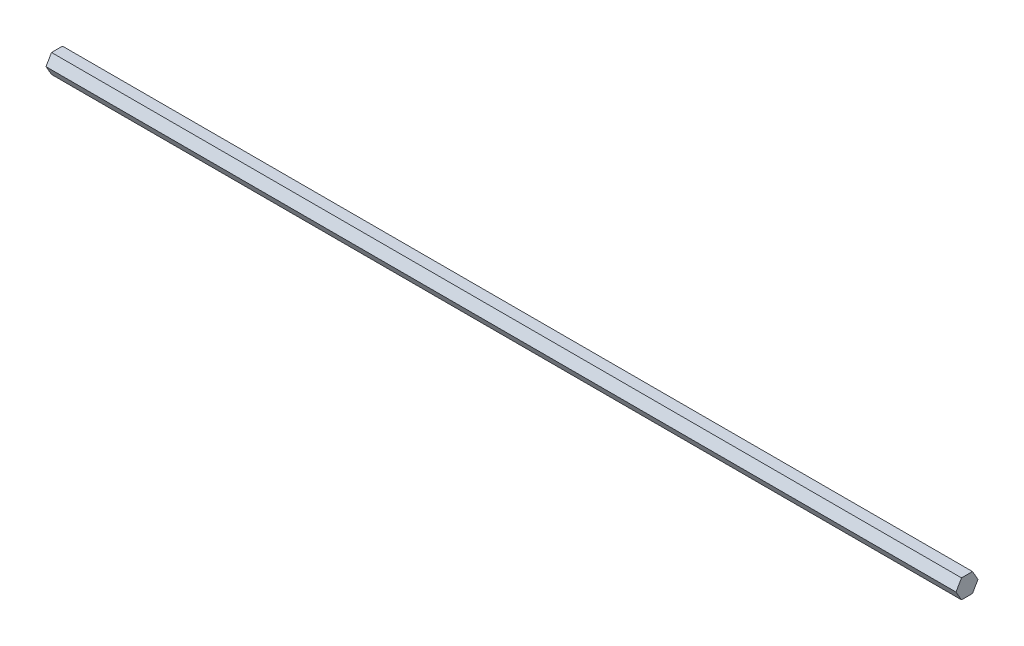
ISO-10303-21;
HEADER;
FILE_DESCRIPTION(('STEP AP214'),'2;1');
FILE_NAME('part.step','',(''),(''),'','','');
FILE_SCHEMA(('AUTOMOTIVE_DESIGN { 1 0 10303 214 1 1 1 1 }'));
ENDSEC;
DATA;
#1=APPLICATION_CONTEXT('core data for automotive mechanical design processes');
#2=APPLICATION_PROTOCOL_DEFINITION('international standard','automotive_design',2000,#1);
#3=PRODUCT_CONTEXT('',#1,'mechanical');
#4=PRODUCT('Part','Part','',(#3));
#5=PRODUCT_RELATED_PRODUCT_CATEGORY('part','',(#4));
#6=PRODUCT_DEFINITION_FORMATION('','',#4);
#7=PRODUCT_DEFINITION_CONTEXT('part definition',#1,'design');
#8=PRODUCT_DEFINITION('design','',#6,#7);
#9=PRODUCT_DEFINITION_SHAPE('','',#8);
#10=(LENGTH_UNIT() NAMED_UNIT(*) SI_UNIT(.MILLI.,.METRE.));
#11=(NAMED_UNIT(*) PLANE_ANGLE_UNIT() SI_UNIT($,.RADIAN.));
#12=(NAMED_UNIT(*) SI_UNIT($,.STERADIAN.) SOLID_ANGLE_UNIT());
#13=UNCERTAINTY_MEASURE_WITH_UNIT(LENGTH_MEASURE(1.E-05),#10,'distance_accuracy_value','');
#14=(GEOMETRIC_REPRESENTATION_CONTEXT(3) GLOBAL_UNCERTAINTY_ASSIGNED_CONTEXT((#13)) GLOBAL_UNIT_ASSIGNED_CONTEXT((#10,
#11,#12)) REPRESENTATION_CONTEXT('',''));
#15=CARTESIAN_POINT('',(0.,0.,0.));
#16=DIRECTION('',(0.,0.,1.));
#17=DIRECTION('',(1.,0.,0.));
#18=AXIS2_PLACEMENT_3D('',#15,#16,#17);
#19=CARTESIAN_POINT('',(303.2125,-6.34999999999996,-3.6661742093542));
#20=DIRECTION('',(0.,0.499999999999995,0.866025403784442));
#21=DIRECTION('',(0.,-0.866025403784441,0.499999999999995));
#22=AXIS2_PLACEMENT_3D('',#19,#20,#21);
#23=PLANE('',#22);
#24=DIRECTION('',(0.,0.866025403784442,-0.499999999999995));
#25=VECTOR('',#24,1.);
#26=CARTESIAN_POINT('',(-303.2125,-6.34999999999996,-3.6661742093542));
#27=LINE('',#26,#25);
#28=CARTESIAN_POINT('',(-303.2125,-6.34999999999996,-3.6661742093542));
#29=VERTEX_POINT('',#28);
#30=CARTESIAN_POINT('',(-303.2125,0.,-7.33234841870825));
#31=VERTEX_POINT('',#30);
#32=EDGE_CURVE('E117',#29,#31,#27,.T.);
#33=ORIENTED_EDGE('',*,*,#32,.T.);
#34=DIRECTION('',(-1.,0.,0.));
#35=VECTOR('',#34,1.);
#36=CARTESIAN_POINT('',(303.2125,0.,-7.33234841870825));
#37=LINE('',#36,#35);
#38=CARTESIAN_POINT('',(303.2125,0.,-7.33234841870825));
#39=VERTEX_POINT('',#38);
#40=EDGE_CURVE('E11',#39,#31,#37,.T.);
#41=ORIENTED_EDGE('',*,*,#40,.F.);
#42=DIRECTION('',(0.,0.866025403784442,-0.499999999999995));
#43=VECTOR('',#42,1.);
#44=CARTESIAN_POINT('',(303.2125,-6.34999999999996,-3.6661742093542));
#45=LINE('',#44,#43);
#46=CARTESIAN_POINT('',(303.2125,-6.34999999999996,-3.6661742093542));
#47=VERTEX_POINT('',#46);
#48=EDGE_CURVE('E127',#47,#39,#45,.T.);
#49=ORIENTED_EDGE('',*,*,#48,.F.);
#50=DIRECTION('',(-1.,0.,0.));
#51=VECTOR('',#50,1.);
#52=CARTESIAN_POINT('',(303.2125,-6.34999999999996,-3.6661742093542));
#53=LINE('',#52,#51);
#54=EDGE_CURVE('E113',#47,#29,#53,.T.);
#55=ORIENTED_EDGE('',*,*,#54,.T.);
#56=EDGE_LOOP('',(#33,#41,#49,#55));
#57=FACE_BOUND('',#56,.T.);
#58=ADVANCED_FACE('F33',(#57),#23,.F.);
#59=CARTESIAN_POINT('',(303.2125,0.,-7.33234841870825));
#60=DIRECTION('',(0.,-0.500000000000001,0.866025403784438));
#61=DIRECTION('',(0.,-0.866025403784438,-0.500000000000001));
#62=AXIS2_PLACEMENT_3D('',#59,#60,#61);
#63=PLANE('',#62);
#64=DIRECTION('',(0.,0.866025403784438,0.500000000000001));
#65=VECTOR('',#64,1.);
#66=CARTESIAN_POINT('',(-303.2125,0.,-7.33234841870825));
#67=LINE('',#66,#65);
#68=CARTESIAN_POINT('',(-303.2125,6.35000000000001,-3.66617420935411));
#69=VERTEX_POINT('',#68);
#70=EDGE_CURVE('E120',#31,#69,#67,.T.);
#71=ORIENTED_EDGE('',*,*,#70,.T.);
#72=DIRECTION('',(-1.,0.,0.));
#73=VECTOR('',#72,1.);
#74=CARTESIAN_POINT('',(303.2125,6.35000000000001,-3.66617420935411));
#75=LINE('',#74,#73);
#76=CARTESIAN_POINT('',(303.2125,6.35000000000001,-3.66617420935411));
#77=VERTEX_POINT('',#76);
#78=EDGE_CURVE('E41',#77,#69,#75,.T.);
#79=ORIENTED_EDGE('',*,*,#78,.F.);
#80=DIRECTION('',(0.,0.866025403784438,0.500000000000001));
#81=VECTOR('',#80,1.);
#82=CARTESIAN_POINT('',(303.2125,0.,-7.33234841870825));
#83=LINE('',#82,#81);
#84=EDGE_CURVE('E86',#39,#77,#83,.T.);
#85=ORIENTED_EDGE('',*,*,#84,.F.);
#86=ORIENTED_EDGE('',*,*,#40,.T.);
#87=EDGE_LOOP('',(#71,#79,#85,#86));
#88=FACE_BOUND('',#87,.T.);
#89=ADVANCED_FACE('F151',(#88),#63,.F.);
#90=CARTESIAN_POINT('',(303.2125,6.35000000000001,-3.66617420935411));
#91=DIRECTION('',(0.,-1.,0.));
#92=DIRECTION('',(0.,0.,-1.));
#93=AXIS2_PLACEMENT_3D('',#90,#91,#92);
#94=PLANE('',#93);
#95=DIRECTION('',(0.,0.,1.));
#96=VECTOR('',#95,1.);
#97=CARTESIAN_POINT('',(-303.2125,6.35000000000001,-3.66617420935411));
#98=LINE('',#97,#96);
#99=CARTESIAN_POINT('',(-303.2125,6.34999999999999,3.66617420935416));
#100=VERTEX_POINT('',#99);
#101=EDGE_CURVE('E122',#69,#100,#98,.T.);
#102=ORIENTED_EDGE('',*,*,#101,.T.);
#103=DIRECTION('',(-1.,0.,0.));
#104=VECTOR('',#103,1.);
#105=CARTESIAN_POINT('',(303.2125,6.34999999999999,3.66617420935416));
#106=LINE('',#105,#104);
#107=CARTESIAN_POINT('',(303.2125,6.34999999999999,3.66617420935416));
#108=VERTEX_POINT('',#107);
#109=EDGE_CURVE('E108',#108,#100,#106,.T.);
#110=ORIENTED_EDGE('',*,*,#109,.F.);
#111=DIRECTION('',(0.,0.,1.));
#112=VECTOR('',#111,1.);
#113=CARTESIAN_POINT('',(303.2125,6.35000000000001,-3.66617420935411));
#114=LINE('',#113,#112);
#115=EDGE_CURVE('E99',#77,#108,#114,.T.);
#116=ORIENTED_EDGE('',*,*,#115,.F.);
#117=ORIENTED_EDGE('',*,*,#78,.T.);
#118=EDGE_LOOP('',(#102,#110,#116,#117));
#119=FACE_BOUND('',#118,.T.);
#120=ADVANCED_FACE('F133',(#119),#94,.F.);
#121=CARTESIAN_POINT('',(303.2125,6.34999999999999,3.66617420935416));
#122=DIRECTION('',(0.,-0.499999999999995,-0.866025403784441));
#123=DIRECTION('',(0.,0.866025403784442,-0.499999999999995));
#124=AXIS2_PLACEMENT_3D('',#121,#122,#123);
#125=PLANE('',#124);
#126=DIRECTION('',(0.,-0.866025403784442,0.499999999999995));
#127=VECTOR('',#126,1.);
#128=CARTESIAN_POINT('',(-303.2125,6.34999999999999,3.66617420935416));
#129=LINE('',#128,#127);
#130=CARTESIAN_POINT('',(-303.2125,0.,7.33234841870825));
#131=VERTEX_POINT('',#130);
#132=EDGE_CURVE('E107',#100,#131,#129,.T.);
#133=ORIENTED_EDGE('',*,*,#132,.T.);
#134=DIRECTION('',(-1.,0.,0.));
#135=VECTOR('',#134,1.);
#136=CARTESIAN_POINT('',(303.2125,0.,7.33234841870825));
#137=LINE('',#136,#135);
#138=CARTESIAN_POINT('',(303.2125,0.,7.33234841870825));
#139=VERTEX_POINT('',#138);
#140=EDGE_CURVE('E104',#139,#131,#137,.T.);
#141=ORIENTED_EDGE('',*,*,#140,.F.);
#142=DIRECTION('',(0.,-0.866025403784442,0.499999999999995));
#143=VECTOR('',#142,1.);
#144=CARTESIAN_POINT('',(303.2125,6.34999999999999,3.66617420935416));
#145=LINE('',#144,#143);
#146=EDGE_CURVE('E93',#108,#139,#145,.T.);
#147=ORIENTED_EDGE('',*,*,#146,.F.);
#148=ORIENTED_EDGE('',*,*,#109,.T.);
#149=EDGE_LOOP('',(#133,#141,#147,#148));
#150=FACE_BOUND('',#149,.T.);
#151=ADVANCED_FACE('F105',(#150),#125,.F.);
#152=CARTESIAN_POINT('',(303.2125,0.,7.33234841870825));
#153=DIRECTION('',(0.,0.500000000000007,-0.866025403784434));
#154=DIRECTION('',(0.,0.866025403784435,0.500000000000007));
#155=AXIS2_PLACEMENT_3D('',#152,#153,#154);
#156=PLANE('',#155);
#157=DIRECTION('',(0.,-0.866025403784435,-0.500000000000007));
#158=VECTOR('',#157,1.);
#159=CARTESIAN_POINT('',(-303.2125,0.,7.33234841870825));
#160=LINE('',#159,#158);
#161=CARTESIAN_POINT('',(-303.2125,-6.35000000000004,3.66617420935407));
#162=VERTEX_POINT('',#161);
#163=EDGE_CURVE('E72',#131,#162,#160,.T.);
#164=ORIENTED_EDGE('',*,*,#163,.T.);
#165=DIRECTION('',(-1.,0.,0.));
#166=VECTOR('',#165,1.);
#167=CARTESIAN_POINT('',(303.2125,-6.35000000000004,3.66617420935407));
#168=LINE('',#167,#166);
#169=CARTESIAN_POINT('',(303.2125,-6.35000000000004,3.66617420935407));
#170=VERTEX_POINT('',#169);
#171=EDGE_CURVE('E109',#170,#162,#168,.T.);
#172=ORIENTED_EDGE('',*,*,#171,.F.);
#173=DIRECTION('',(0.,-0.866025403784435,-0.500000000000007));
#174=VECTOR('',#173,1.);
#175=CARTESIAN_POINT('',(303.2125,0.,7.33234841870825));
#176=LINE('',#175,#174);
#177=EDGE_CURVE('E97',#139,#170,#176,.T.);
#178=ORIENTED_EDGE('',*,*,#177,.F.);
#179=ORIENTED_EDGE('',*,*,#140,.T.);
#180=EDGE_LOOP('',(#164,#172,#178,#179));
#181=FACE_BOUND('',#180,.T.);
#182=ADVANCED_FACE('F111',(#181),#156,.F.);
#183=CARTESIAN_POINT('',(303.2125,-6.35000000000004,3.66617420935407));
#184=DIRECTION('',(0.,1.,0.));
#185=DIRECTION('',(0.,0.,1.));
#186=AXIS2_PLACEMENT_3D('',#183,#184,#185);
#187=PLANE('',#186);
#188=DIRECTION('',(0.,0.,-1.));
#189=VECTOR('',#188,1.);
#190=CARTESIAN_POINT('',(-303.2125,-6.35000000000004,3.66617420935407));
#191=LINE('',#190,#189);
#192=EDGE_CURVE('E78',#162,#29,#191,.T.);
#193=ORIENTED_EDGE('',*,*,#192,.T.);
#194=ORIENTED_EDGE('',*,*,#54,.F.);
#195=DIRECTION('',(0.,0.,-1.));
#196=VECTOR('',#195,1.);
#197=CARTESIAN_POINT('',(303.2125,-6.35000000000004,3.66617420935407));
#198=LINE('',#197,#196);
#199=EDGE_CURVE('E49',#170,#47,#198,.T.);
#200=ORIENTED_EDGE('',*,*,#199,.F.);
#201=ORIENTED_EDGE('',*,*,#171,.T.);
#202=EDGE_LOOP('',(#193,#194,#200,#201));
#203=FACE_BOUND('',#202,.T.);
#204=ADVANCED_FACE('F140',(#203),#187,.F.);
#205=CARTESIAN_POINT('',(303.2125,0.,0.));
#206=DIRECTION('',(1.,0.,0.));
#207=DIRECTION('',(0.,0.,-1.));
#208=AXIS2_PLACEMENT_3D('',#205,#206,#207);
#209=PLANE('',#208);
#210=ORIENTED_EDGE('',*,*,#48,.T.);
#211=ORIENTED_EDGE('',*,*,#84,.T.);
#212=ORIENTED_EDGE('',*,*,#115,.T.);
#213=ORIENTED_EDGE('',*,*,#146,.T.);
#214=ORIENTED_EDGE('',*,*,#177,.T.);
#215=ORIENTED_EDGE('',*,*,#199,.T.);
#216=EDGE_LOOP('',(#210,#211,#212,#213,#214,#215));
#217=FACE_BOUND('',#216,.T.);
#218=ADVANCED_FACE('F95',(#217),#209,.T.);
#219=CARTESIAN_POINT('',(-303.2125,0.,0.));
#220=DIRECTION('',(1.,0.,0.));
#221=DIRECTION('',(0.,0.,-1.));
#222=AXIS2_PLACEMENT_3D('',#219,#220,#221);
#223=PLANE('',#222);
#224=ORIENTED_EDGE('',*,*,#32,.F.);
#225=ORIENTED_EDGE('',*,*,#192,.F.);
#226=ORIENTED_EDGE('',*,*,#163,.F.);
#227=ORIENTED_EDGE('',*,*,#132,.F.);
#228=ORIENTED_EDGE('',*,*,#101,.F.);
#229=ORIENTED_EDGE('',*,*,#70,.F.);
#230=EDGE_LOOP('',(#224,#225,#226,#227,#228,#229));
#231=FACE_BOUND('',#230,.T.);
#232=ADVANCED_FACE('F136',(#231),#223,.F.);
#233=CLOSED_SHELL('',(#58,#89,#120,#151,#182,#204,#218,#232));
#234=MANIFOLD_SOLID_BREP('B2',#233);
#235=ADVANCED_BREP_SHAPE_REPRESENTATION('',(#18,#234),#14);
#236=SHAPE_DEFINITION_REPRESENTATION(#9,#235);
ENDSEC;
END-ISO-10303-21;
